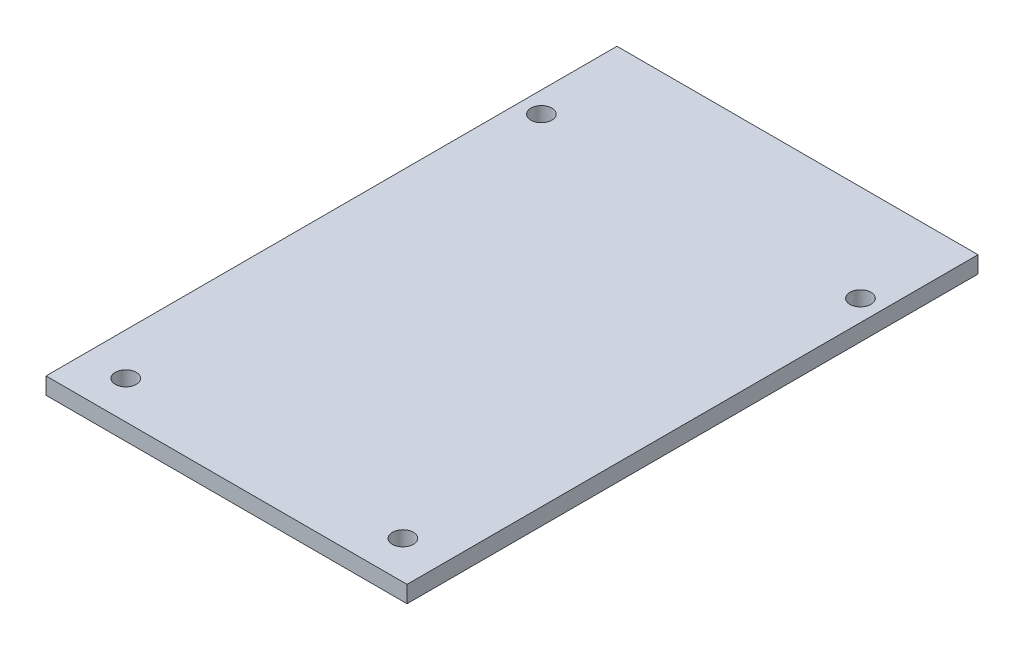
ISO-10303-21;
HEADER;
FILE_DESCRIPTION(('STEP AP214'),'2;1');
FILE_NAME('part.step','',(''),(''),'','','');
FILE_SCHEMA(('AUTOMOTIVE_DESIGN { 1 0 10303 214 1 1 1 1 }'));
ENDSEC;
DATA;
#1=APPLICATION_CONTEXT('core data for automotive mechanical design processes');
#2=APPLICATION_PROTOCOL_DEFINITION('international standard','automotive_design',2000,#1);
#3=PRODUCT_CONTEXT('',#1,'mechanical');
#4=PRODUCT('Part','Part','',(#3));
#5=PRODUCT_RELATED_PRODUCT_CATEGORY('part','',(#4));
#6=PRODUCT_DEFINITION_FORMATION('','',#4);
#7=PRODUCT_DEFINITION_CONTEXT('part definition',#1,'design');
#8=PRODUCT_DEFINITION('design','',#6,#7);
#9=PRODUCT_DEFINITION_SHAPE('','',#8);
#10=(LENGTH_UNIT() NAMED_UNIT(*) SI_UNIT(.MILLI.,.METRE.));
#11=(NAMED_UNIT(*) PLANE_ANGLE_UNIT() SI_UNIT($,.RADIAN.));
#12=(NAMED_UNIT(*) SI_UNIT($,.STERADIAN.) SOLID_ANGLE_UNIT());
#13=UNCERTAINTY_MEASURE_WITH_UNIT(LENGTH_MEASURE(1.E-05),#10,'distance_accuracy_value','');
#14=(GEOMETRIC_REPRESENTATION_CONTEXT(3) GLOBAL_UNCERTAINTY_ASSIGNED_CONTEXT((#13)) GLOBAL_UNIT_ASSIGNED_CONTEXT((#10,
#11,#12)) REPRESENTATION_CONTEXT('',''));
#15=CARTESIAN_POINT('',(0.,0.,0.));
#16=DIRECTION('',(0.,0.,1.));
#17=DIRECTION('',(1.,0.,0.));
#18=AXIS2_PLACEMENT_3D('',#15,#16,#17);
#19=CARTESIAN_POINT('',(0.,2.54,0.));
#20=DIRECTION('',(1.,0.,0.));
#21=DIRECTION('',(0.,0.,-1.));
#22=AXIS2_PLACEMENT_3D('',#19,#20,#21);
#23=PLANE('',#22);
#24=DIRECTION('',(0.,0.,1.));
#25=VECTOR('',#24,1.);
#26=CARTESIAN_POINT('',(0.,0.,0.));
#27=LINE('',#26,#25);
#28=CARTESIAN_POINT('',(0.,0.,-86.36));
#29=VERTEX_POINT('',#28);
#30=CARTESIAN_POINT('',(0.,0.,0.));
#31=VERTEX_POINT('',#30);
#32=EDGE_CURVE('E96',#29,#31,#27,.T.);
#33=ORIENTED_EDGE('',*,*,#32,.T.);
#34=DIRECTION('',(0.,-1.,0.));
#35=VECTOR('',#34,1.);
#36=CARTESIAN_POINT('',(0.,2.54,0.));
#37=LINE('',#36,#35);
#38=CARTESIAN_POINT('',(0.,2.54,0.));
#39=VERTEX_POINT('',#38);
#40=EDGE_CURVE('E11',#39,#31,#37,.T.);
#41=ORIENTED_EDGE('',*,*,#40,.F.);
#42=DIRECTION('',(0.,0.,1.));
#43=VECTOR('',#42,1.);
#44=CARTESIAN_POINT('',(0.,2.54,0.));
#45=LINE('',#44,#43);
#46=CARTESIAN_POINT('',(0.,2.54,-86.36));
#47=VERTEX_POINT('',#46);
#48=EDGE_CURVE('E84',#47,#39,#45,.T.);
#49=ORIENTED_EDGE('',*,*,#48,.F.);
#50=DIRECTION('',(0.,-1.,0.));
#51=VECTOR('',#50,1.);
#52=CARTESIAN_POINT('',(0.,2.54,-86.36));
#53=LINE('',#52,#51);
#54=EDGE_CURVE('E92',#47,#29,#53,.T.);
#55=ORIENTED_EDGE('',*,*,#54,.T.);
#56=EDGE_LOOP('',(#33,#41,#49,#55));
#57=FACE_BOUND('',#56,.T.);
#58=ADVANCED_FACE('F33',(#57),#23,.F.);
#59=CARTESIAN_POINT('',(0.,2.54,0.));
#60=DIRECTION('',(0.,0.,-1.));
#61=DIRECTION('',(-1.,0.,0.));
#62=AXIS2_PLACEMENT_3D('',#59,#60,#61);
#63=PLANE('',#62);
#64=DIRECTION('',(1.,0.,0.));
#65=VECTOR('',#64,1.);
#66=CARTESIAN_POINT('',(0.,0.,0.));
#67=LINE('',#66,#65);
#68=CARTESIAN_POINT('',(54.61,0.,0.));
#69=VERTEX_POINT('',#68);
#70=EDGE_CURVE('E88',#31,#69,#67,.T.);
#71=ORIENTED_EDGE('',*,*,#70,.T.);
#72=DIRECTION('',(0.,-1.,0.));
#73=VECTOR('',#72,1.);
#74=CARTESIAN_POINT('',(54.61,2.54,0.));
#75=LINE('',#74,#73);
#76=CARTESIAN_POINT('',(54.61,2.54,0.));
#77=VERTEX_POINT('',#76);
#78=EDGE_CURVE('E41',#77,#69,#75,.T.);
#79=ORIENTED_EDGE('',*,*,#78,.F.);
#80=DIRECTION('',(1.,0.,0.));
#81=VECTOR('',#80,1.);
#82=CARTESIAN_POINT('',(0.,2.54,0.));
#83=LINE('',#82,#81);
#84=EDGE_CURVE('E79',#39,#77,#83,.T.);
#85=ORIENTED_EDGE('',*,*,#84,.F.);
#86=ORIENTED_EDGE('',*,*,#40,.T.);
#87=EDGE_LOOP('',(#71,#79,#85,#86));
#88=FACE_BOUND('',#87,.T.);
#89=ADVANCED_FACE('F87',(#88),#63,.F.);
#90=CARTESIAN_POINT('',(54.61,2.54,0.));
#91=DIRECTION('',(-1.,0.,0.));
#92=DIRECTION('',(0.,0.,1.));
#93=AXIS2_PLACEMENT_3D('',#90,#91,#92);
#94=PLANE('',#93);
#95=DIRECTION('',(0.,0.,-1.));
#96=VECTOR('',#95,1.);
#97=CARTESIAN_POINT('',(54.61,0.,0.));
#98=LINE('',#97,#96);
#99=CARTESIAN_POINT('',(54.61,0.,-86.36));
#100=VERTEX_POINT('',#99);
#101=EDGE_CURVE('E66',#69,#100,#98,.T.);
#102=ORIENTED_EDGE('',*,*,#101,.T.);
#103=DIRECTION('',(0.,-1.,0.));
#104=VECTOR('',#103,1.);
#105=CARTESIAN_POINT('',(54.61,2.54,-86.36));
#106=LINE('',#105,#104);
#107=CARTESIAN_POINT('',(54.61,2.54,-86.36));
#108=VERTEX_POINT('',#107);
#109=EDGE_CURVE('E89',#108,#100,#106,.T.);
#110=ORIENTED_EDGE('',*,*,#109,.F.);
#111=DIRECTION('',(0.,0.,-1.));
#112=VECTOR('',#111,1.);
#113=CARTESIAN_POINT('',(54.61,2.54,0.));
#114=LINE('',#113,#112);
#115=EDGE_CURVE('E82',#77,#108,#114,.T.);
#116=ORIENTED_EDGE('',*,*,#115,.F.);
#117=ORIENTED_EDGE('',*,*,#78,.T.);
#118=EDGE_LOOP('',(#102,#110,#116,#117));
#119=FACE_BOUND('',#118,.T.);
#120=ADVANCED_FACE('F90',(#119),#94,.F.);
#121=CARTESIAN_POINT('',(0.,2.54,-86.36));
#122=DIRECTION('',(0.,0.,1.));
#123=DIRECTION('',(1.,0.,0.));
#124=AXIS2_PLACEMENT_3D('',#121,#122,#123);
#125=PLANE('',#124);
#126=DIRECTION('',(-1.,0.,0.));
#127=VECTOR('',#126,1.);
#128=CARTESIAN_POINT('',(0.,0.,-86.36));
#129=LINE('',#128,#127);
#130=EDGE_CURVE('E72',#100,#29,#129,.T.);
#131=ORIENTED_EDGE('',*,*,#130,.T.);
#132=ORIENTED_EDGE('',*,*,#54,.F.);
#133=DIRECTION('',(-1.,0.,0.));
#134=VECTOR('',#133,1.);
#135=CARTESIAN_POINT('',(0.,2.54,-86.36));
#136=LINE('',#135,#134);
#137=EDGE_CURVE('E49',#108,#47,#136,.T.);
#138=ORIENTED_EDGE('',*,*,#137,.F.);
#139=ORIENTED_EDGE('',*,*,#109,.T.);
#140=EDGE_LOOP('',(#131,#132,#138,#139));
#141=FACE_BOUND('',#140,.T.);
#142=ADVANCED_FACE('F104',(#141),#125,.F.);
#143=CARTESIAN_POINT('',(0.,2.54,0.));
#144=DIRECTION('',(0.,-1.,0.));
#145=DIRECTION('',(0.,0.,-1.));
#146=AXIS2_PLACEMENT_3D('',#143,#144,#145);
#147=PLANE('',#146);
#148=CARTESIAN_POINT('',(51.435,2.54,-71.755));
#149=DIRECTION('',(0.,1.,0.));
#150=DIRECTION('',(0.,0.,1.));
#151=AXIS2_PLACEMENT_3D('',#148,#149,#150);
#152=CIRCLE('',#151,1.5875);
#153=CARTESIAN_POINT('',(51.435,2.54,-70.1675));
#154=VERTEX_POINT('',#153);
#155=EDGE_CURVE('E128',#154,#154,#152,.T.);
#156=ORIENTED_EDGE('',*,*,#155,.F.);
#157=EDGE_LOOP('',(#156));
#158=FACE_BOUND('',#157,.T.);
#159=CARTESIAN_POINT('',(6.35,2.54,-5.715));
#160=DIRECTION('',(0.,1.,0.));
#161=DIRECTION('',(0.,0.,1.));
#162=AXIS2_PLACEMENT_3D('',#159,#160,#161);
#163=CIRCLE('',#162,1.5875);
#164=CARTESIAN_POINT('',(6.35,2.54,-4.1275));
#165=VERTEX_POINT('',#164);
#166=EDGE_CURVE('E122',#165,#165,#163,.T.);
#167=ORIENTED_EDGE('',*,*,#166,.F.);
#168=EDGE_LOOP('',(#167));
#169=FACE_BOUND('',#168,.T.);
#170=CARTESIAN_POINT('',(48.26,2.54,-5.715));
#171=DIRECTION('',(0.,1.,0.));
#172=DIRECTION('',(0.,0.,1.));
#173=AXIS2_PLACEMENT_3D('',#170,#171,#172);
#174=CIRCLE('',#173,1.5875);
#175=CARTESIAN_POINT('',(48.26,2.54,-4.1275));
#176=VERTEX_POINT('',#175);
#177=EDGE_CURVE('E116',#176,#176,#174,.T.);
#178=ORIENTED_EDGE('',*,*,#177,.F.);
#179=EDGE_LOOP('',(#178));
#180=FACE_BOUND('',#179,.T.);
#181=CARTESIAN_POINT('',(3.175,2.54,-71.755));
#182=DIRECTION('',(0.,1.,0.));
#183=DIRECTION('',(0.,0.,1.));
#184=AXIS2_PLACEMENT_3D('',#181,#182,#183);
#185=CIRCLE('',#184,1.5875);
#186=CARTESIAN_POINT('',(3.175,2.54,-70.1675));
#187=VERTEX_POINT('',#186);
#188=EDGE_CURVE('E110',#187,#187,#185,.T.);
#189=ORIENTED_EDGE('',*,*,#188,.F.);
#190=EDGE_LOOP('',(#189));
#191=FACE_BOUND('',#190,.T.);
#192=ORIENTED_EDGE('',*,*,#48,.T.);
#193=ORIENTED_EDGE('',*,*,#84,.T.);
#194=ORIENTED_EDGE('',*,*,#115,.T.);
#195=ORIENTED_EDGE('',*,*,#137,.T.);
#196=EDGE_LOOP('',(#192,#193,#194,#195));
#197=FACE_BOUND('',#196,.T.);
#198=ADVANCED_FACE('F80',(#158,#169,#180,#191,#197),#147,.F.);
#199=CARTESIAN_POINT('',(0.,0.,0.));
#200=DIRECTION('',(0.,-1.,0.));
#201=DIRECTION('',(0.,0.,-1.));
#202=AXIS2_PLACEMENT_3D('',#199,#200,#201);
#203=PLANE('',#202);
#204=CARTESIAN_POINT('',(51.435,0.,-71.755));
#205=DIRECTION('',(0.,1.,0.));
#206=DIRECTION('',(0.,0.,1.));
#207=AXIS2_PLACEMENT_3D('',#204,#205,#206);
#208=CIRCLE('',#207,1.5875);
#209=CARTESIAN_POINT('',(51.435,0.,-70.1675));
#210=VERTEX_POINT('',#209);
#211=EDGE_CURVE('E113',#210,#210,#208,.T.);
#212=ORIENTED_EDGE('',*,*,#211,.T.);
#213=EDGE_LOOP('',(#212));
#214=FACE_BOUND('',#213,.T.);
#215=CARTESIAN_POINT('',(6.35,0.,-5.715));
#216=DIRECTION('',(0.,1.,0.));
#217=DIRECTION('',(0.,0.,1.));
#218=AXIS2_PLACEMENT_3D('',#215,#216,#217);
#219=CIRCLE('',#218,1.5875);
#220=CARTESIAN_POINT('',(6.35,0.,-4.1275));
#221=VERTEX_POINT('',#220);
#222=EDGE_CURVE('E125',#221,#221,#219,.T.);
#223=ORIENTED_EDGE('',*,*,#222,.T.);
#224=EDGE_LOOP('',(#223));
#225=FACE_BOUND('',#224,.T.);
#226=CARTESIAN_POINT('',(48.26,0.,-5.715));
#227=DIRECTION('',(0.,1.,0.));
#228=DIRECTION('',(0.,0.,1.));
#229=AXIS2_PLACEMENT_3D('',#226,#227,#228);
#230=CIRCLE('',#229,1.5875);
#231=CARTESIAN_POINT('',(48.26,0.,-4.1275));
#232=VERTEX_POINT('',#231);
#233=EDGE_CURVE('E119',#232,#232,#230,.T.);
#234=ORIENTED_EDGE('',*,*,#233,.T.);
#235=EDGE_LOOP('',(#234));
#236=FACE_BOUND('',#235,.T.);
#237=CARTESIAN_POINT('',(3.175,0.,-71.755));
#238=DIRECTION('',(0.,1.,0.));
#239=DIRECTION('',(0.,0.,1.));
#240=AXIS2_PLACEMENT_3D('',#237,#238,#239);
#241=CIRCLE('',#240,1.5875);
#242=CARTESIAN_POINT('',(3.175,0.,-70.1675));
#243=VERTEX_POINT('',#242);
#244=EDGE_CURVE('E99',#243,#243,#241,.T.);
#245=ORIENTED_EDGE('',*,*,#244,.T.);
#246=EDGE_LOOP('',(#245));
#247=FACE_BOUND('',#246,.T.);
#248=ORIENTED_EDGE('',*,*,#32,.F.);
#249=ORIENTED_EDGE('',*,*,#130,.F.);
#250=ORIENTED_EDGE('',*,*,#101,.F.);
#251=ORIENTED_EDGE('',*,*,#70,.F.);
#252=EDGE_LOOP('',(#248,#249,#250,#251));
#253=FACE_BOUND('',#252,.T.);
#254=ADVANCED_FACE('F107',(#214,#225,#236,#247,#253),#203,.T.);
#255=CARTESIAN_POINT('',(3.175,0.,-71.755));
#256=DIRECTION('',(0.,1.,0.));
#257=DIRECTION('',(0.,0.,1.));
#258=AXIS2_PLACEMENT_3D('',#255,#256,#257);
#259=CYLINDRICAL_SURFACE('',#258,1.5875);
#260=ORIENTED_EDGE('',*,*,#244,.F.);
#261=EDGE_LOOP('',(#260));
#262=FACE_BOUND('',#261,.T.);
#263=ORIENTED_EDGE('',*,*,#188,.T.);
#264=EDGE_LOOP('',(#263));
#265=FACE_BOUND('',#264,.T.);
#266=ADVANCED_FACE('F152',(#262,#265),#259,.F.);
#267=CARTESIAN_POINT('',(48.26,0.,-5.715));
#268=DIRECTION('',(0.,1.,0.));
#269=DIRECTION('',(0.,0.,1.));
#270=AXIS2_PLACEMENT_3D('',#267,#268,#269);
#271=CYLINDRICAL_SURFACE('',#270,1.5875);
#272=ORIENTED_EDGE('',*,*,#233,.F.);
#273=EDGE_LOOP('',(#272));
#274=FACE_BOUND('',#273,.T.);
#275=ORIENTED_EDGE('',*,*,#177,.T.);
#276=EDGE_LOOP('',(#275));
#277=FACE_BOUND('',#276,.T.);
#278=ADVANCED_FACE('F154',(#274,#277),#271,.F.);
#279=CARTESIAN_POINT('',(6.35,0.,-5.715));
#280=DIRECTION('',(0.,1.,0.));
#281=DIRECTION('',(0.,0.,1.));
#282=AXIS2_PLACEMENT_3D('',#279,#280,#281);
#283=CYLINDRICAL_SURFACE('',#282,1.5875);
#284=ORIENTED_EDGE('',*,*,#222,.F.);
#285=EDGE_LOOP('',(#284));
#286=FACE_BOUND('',#285,.T.);
#287=ORIENTED_EDGE('',*,*,#166,.T.);
#288=EDGE_LOOP('',(#287));
#289=FACE_BOUND('',#288,.T.);
#290=ADVANCED_FACE('F139',(#286,#289),#283,.F.);
#291=CARTESIAN_POINT('',(51.435,0.,-71.755));
#292=DIRECTION('',(0.,1.,0.));
#293=DIRECTION('',(0.,0.,1.));
#294=AXIS2_PLACEMENT_3D('',#291,#292,#293);
#295=CYLINDRICAL_SURFACE('',#294,1.5875);
#296=ORIENTED_EDGE('',*,*,#211,.F.);
#297=EDGE_LOOP('',(#296));
#298=FACE_BOUND('',#297,.T.);
#299=ORIENTED_EDGE('',*,*,#155,.T.);
#300=EDGE_LOOP('',(#299));
#301=FACE_BOUND('',#300,.T.);
#302=ADVANCED_FACE('F136',(#298,#301),#295,.F.);
#303=CLOSED_SHELL('',(#58,#89,#120,#142,#198,#254,#266,#278,#290,#302));
#304=MANIFOLD_SOLID_BREP('B2',#303);
#305=ADVANCED_BREP_SHAPE_REPRESENTATION('',(#18,#304),#14);
#306=SHAPE_DEFINITION_REPRESENTATION(#9,#305);
ENDSEC;
END-ISO-10303-21;
